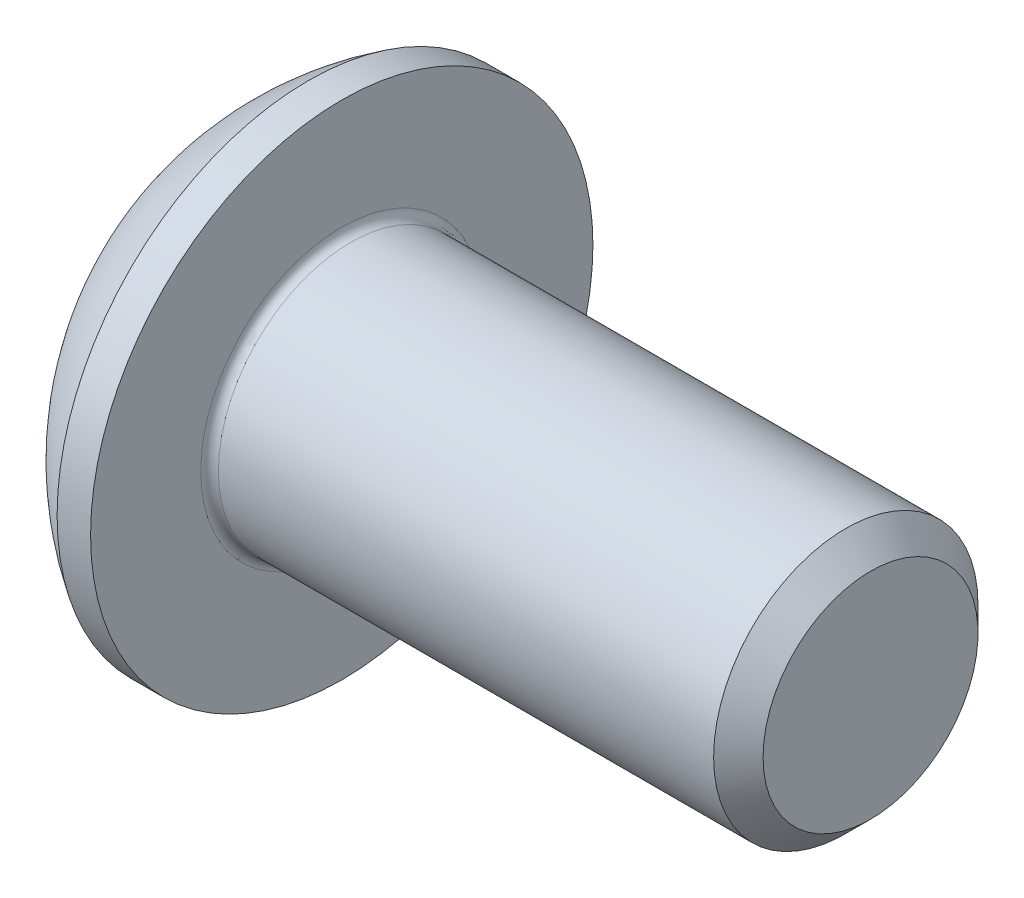
ISO-10303-21;
HEADER;
FILE_DESCRIPTION(('STEP AP214'),'2;1');
FILE_NAME('part.step','',(''),(''),'','','');
FILE_SCHEMA(('AUTOMOTIVE_DESIGN { 1 0 10303 214 1 1 1 1 }'));
ENDSEC;
DATA;
#1=APPLICATION_CONTEXT('core data for automotive mechanical design processes');
#2=APPLICATION_PROTOCOL_DEFINITION('international standard','automotive_design',2000,#1);
#3=PRODUCT_CONTEXT('',#1,'mechanical');
#4=PRODUCT('Part','Part','',(#3));
#5=PRODUCT_RELATED_PRODUCT_CATEGORY('part','',(#4));
#6=PRODUCT_DEFINITION_FORMATION('','',#4);
#7=PRODUCT_DEFINITION_CONTEXT('part definition',#1,'design');
#8=PRODUCT_DEFINITION('design','',#6,#7);
#9=PRODUCT_DEFINITION_SHAPE('','',#8);
#10=(LENGTH_UNIT() NAMED_UNIT(*) SI_UNIT(.MILLI.,.METRE.));
#11=(NAMED_UNIT(*) PLANE_ANGLE_UNIT() SI_UNIT($,.RADIAN.));
#12=(NAMED_UNIT(*) SI_UNIT($,.STERADIAN.) SOLID_ANGLE_UNIT());
#13=UNCERTAINTY_MEASURE_WITH_UNIT(LENGTH_MEASURE(1.E-05),#10,'distance_accuracy_value','');
#14=(GEOMETRIC_REPRESENTATION_CONTEXT(3) GLOBAL_UNCERTAINTY_ASSIGNED_CONTEXT((#13)) GLOBAL_UNIT_ASSIGNED_CONTEXT((#10,
#11,#12)) REPRESENTATION_CONTEXT('',''));
#15=CARTESIAN_POINT('',(0.,0.,0.));
#16=DIRECTION('',(0.,0.,1.));
#17=DIRECTION('',(1.,0.,0.));
#18=AXIS2_PLACEMENT_3D('',#15,#16,#17);
#19=CARTESIAN_POINT('',(0.,0.,0.));
#20=DIRECTION('',(-1.,0.,0.));
#21=DIRECTION('',(0.,0.,1.));
#22=AXIS2_PLACEMENT_3D('',#19,#20,#21);
#23=PLANE('',#22);
#24=CARTESIAN_POINT('',(0.,0.,0.));
#25=DIRECTION('',(-1.,0.,0.));
#26=DIRECTION('',(0.,0.,1.));
#27=AXIS2_PLACEMENT_3D('',#24,#25,#26);
#28=CIRCLE('',#27,1.425);
#29=CARTESIAN_POINT('',(0.,0.,1.425));
#30=VERTEX_POINT('',#29);
#31=EDGE_CURVE('E152',#30,#30,#28,.T.);
#32=ORIENTED_EDGE('',*,*,#31,.T.);
#33=EDGE_LOOP('',(#32));
#34=FACE_BOUND('',#33,.T.);
#35=DIRECTION('',(0.,-1.,0.));
#36=VECTOR('',#35,1.);
#37=CARTESIAN_POINT('',(0.,-0.577350269189625,0.999999999999998));
#38=LINE('',#37,#36);
#39=CARTESIAN_POINT('',(0.,0.577350269189628,1.));
#40=VERTEX_POINT('',#39);
#41=CARTESIAN_POINT('',(0.,-0.577350269189625,0.999999999999998));
#42=VERTEX_POINT('',#41);
#43=EDGE_CURVE('E47',#40,#42,#38,.T.);
#44=ORIENTED_EDGE('',*,*,#43,.T.);
#45=DIRECTION('',(0.,-0.499999999999999,-0.866025403784439));
#46=VECTOR('',#45,1.);
#47=CARTESIAN_POINT('',(0.,-1.15470053837925,0.));
#48=LINE('',#47,#46);
#49=CARTESIAN_POINT('',(0.,-1.15470053837925,0.));
#50=VERTEX_POINT('',#49);
#51=EDGE_CURVE('E272',#42,#50,#48,.T.);
#52=ORIENTED_EDGE('',*,*,#51,.T.);
#53=DIRECTION('',(0.,0.499999999999997,-0.86602540378444));
#54=VECTOR('',#53,1.);
#55=CARTESIAN_POINT('',(0.,-0.577350269189626,-1.));
#56=LINE('',#55,#54);
#57=CARTESIAN_POINT('',(0.,-0.577350269189626,-1.));
#58=VERTEX_POINT('',#57);
#59=EDGE_CURVE('E127',#50,#58,#56,.T.);
#60=ORIENTED_EDGE('',*,*,#59,.T.);
#61=DIRECTION('',(0.,1.,0.));
#62=VECTOR('',#61,1.);
#63=CARTESIAN_POINT('',(0.,0.577350269189628,-1.));
#64=LINE('',#63,#62);
#65=CARTESIAN_POINT('',(0.,0.577350269189628,-1.));
#66=VERTEX_POINT('',#65);
#67=EDGE_CURVE('E275',#58,#66,#64,.T.);
#68=ORIENTED_EDGE('',*,*,#67,.T.);
#69=DIRECTION('',(0.,0.499999999999998,0.866025403784439));
#70=VECTOR('',#69,1.);
#71=CARTESIAN_POINT('',(0.,1.15470053837925,0.));
#72=LINE('',#71,#70);
#73=CARTESIAN_POINT('',(0.,1.15470053837925,0.));
#74=VERTEX_POINT('',#73);
#75=EDGE_CURVE('E277',#66,#74,#72,.T.);
#76=ORIENTED_EDGE('',*,*,#75,.T.);
#77=DIRECTION('',(0.,-0.499999999999998,0.866025403784439));
#78=VECTOR('',#77,1.);
#79=CARTESIAN_POINT('',(0.,0.577350269189628,1.));
#80=LINE('',#79,#78);
#81=EDGE_CURVE('E279',#74,#40,#80,.T.);
#82=ORIENTED_EDGE('',*,*,#81,.T.);
#83=EDGE_LOOP('',(#44,#52,#60,#68,#76,#82));
#84=FACE_BOUND('',#83,.T.);
#85=ADVANCED_FACE('F32',(#34,#84),#23,.T.);
#86=CARTESIAN_POINT('',(3.03337598425198,0.,0.));
#87=DIRECTION('',(-1.,0.,0.));
#88=DIRECTION('',(0.,1.,0.));
#89=AXIS2_PLACEMENT_3D('',#86,#87,#88);
#90=SPHERICAL_SURFACE('',#89,3.35141684393879);
#91=CARTESIAN_POINT('',(1.27,0.,0.));
#92=DIRECTION('',(-1.,0.,0.));
#93=DIRECTION('',(0.,0.,1.));
#94=AXIS2_PLACEMENT_3D('',#91,#92,#93);
#95=CIRCLE('',#94,2.85);
#96=CARTESIAN_POINT('',(1.27,0.,2.85));
#97=VERTEX_POINT('',#96);
#98=EDGE_CURVE('E149',#97,#97,#95,.T.);
#99=ORIENTED_EDGE('',*,*,#98,.T.);
#100=EDGE_LOOP('',(#99));
#101=FACE_BOUND('',#100,.T.);
#102=ORIENTED_EDGE('',*,*,#31,.F.);
#103=EDGE_LOOP('',(#102));
#104=FACE_BOUND('',#103,.T.);
#105=ADVANCED_FACE('F173',(#101,#104),#90,.T.);
#106=CARTESIAN_POINT('',(0.,0.,0.));
#107=DIRECTION('',(-1.,0.,0.));
#108=DIRECTION('',(0.,0.,1.));
#109=AXIS2_PLACEMENT_3D('',#106,#107,#108);
#110=CYLINDRICAL_SURFACE('',#109,2.85);
#111=ORIENTED_EDGE('',*,*,#98,.F.);
#112=EDGE_LOOP('',(#111));
#113=FACE_BOUND('',#112,.T.);
#114=CARTESIAN_POINT('',(1.65,0.,0.));
#115=DIRECTION('',(-1.,0.,0.));
#116=DIRECTION('',(0.,0.,1.));
#117=AXIS2_PLACEMENT_3D('',#114,#115,#116);
#118=CIRCLE('',#117,2.85);
#119=CARTESIAN_POINT('',(1.65,0.,2.85));
#120=VERTEX_POINT('',#119);
#121=EDGE_CURVE('E146',#120,#120,#118,.T.);
#122=ORIENTED_EDGE('',*,*,#121,.T.);
#123=EDGE_LOOP('',(#122));
#124=FACE_BOUND('',#123,.T.);
#125=ADVANCED_FACE('F178',(#113,#124),#110,.T.);
#126=CARTESIAN_POINT('',(1.65,1.49999999999999,0.));
#127=DIRECTION('',(-1.,0.,0.));
#128=DIRECTION('',(0.,0.,1.));
#129=AXIS2_PLACEMENT_3D('',#126,#127,#128);
#130=PLANE('',#129);
#131=CARTESIAN_POINT('',(1.65,0.,0.));
#132=DIRECTION('',(-1.,0.,0.));
#133=DIRECTION('',(0.,0.,1.));
#134=AXIS2_PLACEMENT_3D('',#131,#132,#133);
#135=CIRCLE('',#134,1.6);
#136=CARTESIAN_POINT('',(1.65,0.,1.6));
#137=VERTEX_POINT('',#136);
#138=EDGE_CURVE('E40',#137,#137,#135,.T.);
#139=ORIENTED_EDGE('',*,*,#138,.T.);
#140=EDGE_LOOP('',(#139));
#141=FACE_BOUND('',#140,.T.);
#142=ORIENTED_EDGE('',*,*,#121,.F.);
#143=EDGE_LOOP('',(#142));
#144=FACE_BOUND('',#143,.T.);
#145=ADVANCED_FACE('F157',(#141,#144),#130,.F.);
#146=CARTESIAN_POINT('',(0.,0.,0.));
#147=DIRECTION('',(-1.,0.,0.));
#148=DIRECTION('',(0.,0.,1.));
#149=AXIS2_PLACEMENT_3D('',#146,#147,#148);
#150=CYLINDRICAL_SURFACE('',#149,1.5);
#151=CARTESIAN_POINT('',(1.75,0.,0.));
#152=DIRECTION('',(-1.,0.,0.));
#153=DIRECTION('',(0.,0.,1.));
#154=AXIS2_PLACEMENT_3D('',#151,#152,#153);
#155=CIRCLE('',#154,1.5);
#156=CARTESIAN_POINT('',(1.75,0.,1.5));
#157=VERTEX_POINT('',#156);
#158=EDGE_CURVE('E11',#157,#157,#155,.F.);
#159=ORIENTED_EDGE('',*,*,#158,.T.);
#160=EDGE_LOOP('',(#159));
#161=FACE_BOUND('',#160,.T.);
#162=CARTESIAN_POINT('',(7.3695,0.,0.));
#163=DIRECTION('',(-1.,0.,0.));
#164=DIRECTION('',(0.,0.,1.));
#165=AXIS2_PLACEMENT_3D('',#162,#163,#164);
#166=CIRCLE('',#165,1.5);
#167=CARTESIAN_POINT('',(7.3695,0.,1.5));
#168=VERTEX_POINT('',#167);
#169=EDGE_CURVE('E143',#168,#168,#166,.T.);
#170=ORIENTED_EDGE('',*,*,#169,.T.);
#171=EDGE_LOOP('',(#170));
#172=FACE_BOUND('',#171,.T.);
#173=ADVANCED_FACE('F187',(#161,#172),#150,.T.);
#174=CARTESIAN_POINT('',(7.65,0.,0.));
#175=DIRECTION('',(-1.,0.,0.));
#176=DIRECTION('',(0.,0.,1.));
#177=AXIS2_PLACEMENT_3D('',#174,#175,#176);
#178=CONICAL_SURFACE('',#177,1.2195,0.785398163397446);
#179=ORIENTED_EDGE('',*,*,#169,.F.);
#180=EDGE_LOOP('',(#179));
#181=FACE_BOUND('',#180,.T.);
#182=CARTESIAN_POINT('',(7.65,0.,0.));
#183=DIRECTION('',(-1.,0.,0.));
#184=DIRECTION('',(0.,0.,1.));
#185=AXIS2_PLACEMENT_3D('',#182,#183,#184);
#186=CIRCLE('',#185,1.2195);
#187=CARTESIAN_POINT('',(7.65,0.,1.2195));
#188=VERTEX_POINT('',#187);
#189=EDGE_CURVE('E139',#188,#188,#186,.T.);
#190=ORIENTED_EDGE('',*,*,#189,.T.);
#191=EDGE_LOOP('',(#190));
#192=FACE_BOUND('',#191,.T.);
#193=ADVANCED_FACE('F168',(#181,#192),#178,.T.);
#194=CARTESIAN_POINT('',(7.65,0.,0.));
#195=DIRECTION('',(-1.,0.,0.));
#196=DIRECTION('',(0.,0.,1.));
#197=AXIS2_PLACEMENT_3D('',#194,#195,#196);
#198=PLANE('',#197);
#199=ORIENTED_EDGE('',*,*,#189,.F.);
#200=EDGE_LOOP('',(#199));
#201=FACE_BOUND('',#200,.T.);
#202=ADVANCED_FACE('F161',(#201),#198,.F.);
#203=CARTESIAN_POINT('',(1.75,0.,0.));
#204=DIRECTION('',(-1.,0.,0.));
#205=DIRECTION('',(0.,0.,1.));
#206=AXIS2_PLACEMENT_3D('',#203,#204,#205);
#207=TOROIDAL_SURFACE('',#206,1.6,0.1);
#208=ORIENTED_EDGE('',*,*,#158,.F.);
#209=EDGE_LOOP('',(#208));
#210=FACE_BOUND('',#209,.T.);
#211=ORIENTED_EDGE('',*,*,#138,.F.);
#212=EDGE_LOOP('',(#211));
#213=FACE_BOUND('',#212,.T.);
#214=ADVANCED_FACE('F34',(#210,#213),#207,.F.);
#215=CARTESIAN_POINT('',(1.04,-1.15470053837925,0.));
#216=DIRECTION('',(0.,0.866025403784439,-0.499999999999999));
#217=DIRECTION('',(0.,0.499999999999999,0.866025403784439));
#218=AXIS2_PLACEMENT_3D('',#215,#216,#217);
#219=PLANE('',#218);
#220=DIRECTION('',(0.,-0.499999999999999,-0.866025403784439));
#221=VECTOR('',#220,1.);
#222=CARTESIAN_POINT('',(1.04,-1.15470053837925,0.));
#223=LINE('',#222,#221);
#224=CARTESIAN_POINT('',(1.04,-0.577350269189625,0.999999999999998));
#225=VERTEX_POINT('',#224);
#226=CARTESIAN_POINT('',(1.04,-0.866025403784437,0.499999999999998));
#227=VERTEX_POINT('',#226);
#228=EDGE_CURVE('E113',#225,#227,#223,.T.);
#229=ORIENTED_EDGE('',*,*,#228,.T.);
#230=CARTESIAN_POINT('',(1.04,-1.15470053837925,0.));
#231=VERTEX_POINT('',#230);
#232=EDGE_CURVE('E108',#227,#231,#223,.T.);
#233=ORIENTED_EDGE('',*,*,#232,.T.);
#234=DIRECTION('',(-1.,0.,0.));
#235=VECTOR('',#234,1.);
#236=CARTESIAN_POINT('',(1.04,-1.15470053837925,0.));
#237=LINE('',#236,#235);
#238=EDGE_CURVE('E110',#231,#50,#237,.T.);
#239=ORIENTED_EDGE('',*,*,#238,.T.);
#240=ORIENTED_EDGE('',*,*,#51,.F.);
#241=DIRECTION('',(-1.,0.,0.));
#242=VECTOR('',#241,1.);
#243=CARTESIAN_POINT('',(1.04,-0.577350269189625,0.999999999999998));
#244=LINE('',#243,#242);
#245=EDGE_CURVE('E268',#225,#42,#244,.T.);
#246=ORIENTED_EDGE('',*,*,#245,.F.);
#247=EDGE_LOOP('',(#229,#233,#239,#240,#246));
#248=FACE_BOUND('',#247,.T.);
#249=ADVANCED_FACE('F109',(#248),#219,.T.);
#250=CARTESIAN_POINT('',(1.04,-0.577350269189626,-1.));
#251=DIRECTION('',(0.,0.86602540378444,0.499999999999998));
#252=DIRECTION('',(0.,-0.499999999999998,0.86602540378444));
#253=AXIS2_PLACEMENT_3D('',#250,#251,#252);
#254=PLANE('',#253);
#255=DIRECTION('',(0.,0.499999999999997,-0.86602540378444));
#256=VECTOR('',#255,1.);
#257=CARTESIAN_POINT('',(1.04,-0.577350269189626,-1.));
#258=LINE('',#257,#256);
#259=CARTESIAN_POINT('',(1.04,-0.86602540378444,-0.499999999999997));
#260=VERTEX_POINT('',#259);
#261=EDGE_CURVE('E55',#231,#260,#258,.T.);
#262=ORIENTED_EDGE('',*,*,#261,.T.);
#263=CARTESIAN_POINT('',(1.04,-0.577350269189626,-1.));
#264=VERTEX_POINT('',#263);
#265=EDGE_CURVE('E122',#260,#264,#258,.T.);
#266=ORIENTED_EDGE('',*,*,#265,.T.);
#267=DIRECTION('',(-1.,0.,0.));
#268=VECTOR('',#267,1.);
#269=CARTESIAN_POINT('',(1.04,-0.577350269189626,-1.));
#270=LINE('',#269,#268);
#271=EDGE_CURVE('E129',#264,#58,#270,.T.);
#272=ORIENTED_EDGE('',*,*,#271,.T.);
#273=ORIENTED_EDGE('',*,*,#59,.F.);
#274=ORIENTED_EDGE('',*,*,#238,.F.);
#275=EDGE_LOOP('',(#262,#266,#272,#273,#274));
#276=FACE_BOUND('',#275,.T.);
#277=ADVANCED_FACE('F125',(#276),#254,.T.);
#278=CARTESIAN_POINT('',(1.04,0.577350269189628,-1.));
#279=DIRECTION('',(0.,0.,1.));
#280=DIRECTION('',(0.,-1.,0.));
#281=AXIS2_PLACEMENT_3D('',#278,#279,#280);
#282=PLANE('',#281);
#283=DIRECTION('',(0.,1.,0.));
#284=VECTOR('',#283,1.);
#285=CARTESIAN_POINT('',(1.04,0.577350269189628,-1.));
#286=LINE('',#285,#284);
#287=CARTESIAN_POINT('',(1.04,0.,-1.));
#288=VERTEX_POINT('',#287);
#289=EDGE_CURVE('E249',#264,#288,#286,.T.);
#290=ORIENTED_EDGE('',*,*,#289,.T.);
#291=CARTESIAN_POINT('',(1.04,0.577350269189628,-1.));
#292=VERTEX_POINT('',#291);
#293=EDGE_CURVE('E121',#288,#292,#286,.T.);
#294=ORIENTED_EDGE('',*,*,#293,.T.);
#295=DIRECTION('',(-1.,0.,0.));
#296=VECTOR('',#295,1.);
#297=CARTESIAN_POINT('',(1.04,0.577350269189628,-1.));
#298=LINE('',#297,#296);
#299=EDGE_CURVE('E134',#292,#66,#298,.T.);
#300=ORIENTED_EDGE('',*,*,#299,.T.);
#301=ORIENTED_EDGE('',*,*,#67,.F.);
#302=ORIENTED_EDGE('',*,*,#271,.F.);
#303=EDGE_LOOP('',(#290,#294,#300,#301,#302));
#304=FACE_BOUND('',#303,.T.);
#305=ADVANCED_FACE('F201',(#304),#282,.T.);
#306=CARTESIAN_POINT('',(1.04,1.15470053837925,0.));
#307=DIRECTION('',(0.,-0.86602540378444,0.499999999999998));
#308=DIRECTION('',(0.,-0.499999999999998,-0.86602540378444));
#309=AXIS2_PLACEMENT_3D('',#306,#307,#308);
#310=PLANE('',#309);
#311=DIRECTION('',(0.,0.499999999999998,0.866025403784439));
#312=VECTOR('',#311,1.);
#313=CARTESIAN_POINT('',(1.04,1.15470053837925,0.));
#314=LINE('',#313,#312);
#315=CARTESIAN_POINT('',(1.04,0.86602540378444,-0.499999999999999));
#316=VERTEX_POINT('',#315);
#317=EDGE_CURVE('E238',#292,#316,#314,.T.);
#318=ORIENTED_EDGE('',*,*,#317,.T.);
#319=CARTESIAN_POINT('',(1.04,1.15470053837925,0.));
#320=VERTEX_POINT('',#319);
#321=EDGE_CURVE('E243',#316,#320,#314,.T.);
#322=ORIENTED_EDGE('',*,*,#321,.T.);
#323=DIRECTION('',(-1.,0.,0.));
#324=VECTOR('',#323,1.);
#325=CARTESIAN_POINT('',(1.04,1.15470053837925,0.));
#326=LINE('',#325,#324);
#327=EDGE_CURVE('E283',#320,#74,#326,.T.);
#328=ORIENTED_EDGE('',*,*,#327,.T.);
#329=ORIENTED_EDGE('',*,*,#75,.F.);
#330=ORIENTED_EDGE('',*,*,#299,.F.);
#331=EDGE_LOOP('',(#318,#322,#328,#329,#330));
#332=FACE_BOUND('',#331,.T.);
#333=ADVANCED_FACE('F204',(#332),#310,.T.);
#334=CARTESIAN_POINT('',(1.04,0.577350269189628,1.));
#335=DIRECTION('',(0.,-0.86602540378444,-0.499999999999998));
#336=DIRECTION('',(0.,0.499999999999998,-0.86602540378444));
#337=AXIS2_PLACEMENT_3D('',#334,#335,#336);
#338=PLANE('',#337);
#339=DIRECTION('',(0.,-0.499999999999998,0.866025403784439));
#340=VECTOR('',#339,1.);
#341=CARTESIAN_POINT('',(1.04,0.577350269189628,1.));
#342=LINE('',#341,#340);
#343=CARTESIAN_POINT('',(1.04,0.86602540378444,0.499999999999999));
#344=VERTEX_POINT('',#343);
#345=EDGE_CURVE('E246',#320,#344,#342,.T.);
#346=ORIENTED_EDGE('',*,*,#345,.T.);
#347=CARTESIAN_POINT('',(1.04,0.577350269189628,1.));
#348=VERTEX_POINT('',#347);
#349=EDGE_CURVE('E254',#344,#348,#342,.T.);
#350=ORIENTED_EDGE('',*,*,#349,.T.);
#351=DIRECTION('',(-1.,0.,0.));
#352=VECTOR('',#351,1.);
#353=CARTESIAN_POINT('',(1.04,0.577350269189628,1.));
#354=LINE('',#353,#352);
#355=EDGE_CURVE('E267',#348,#40,#354,.T.);
#356=ORIENTED_EDGE('',*,*,#355,.T.);
#357=ORIENTED_EDGE('',*,*,#81,.F.);
#358=ORIENTED_EDGE('',*,*,#327,.F.);
#359=EDGE_LOOP('',(#346,#350,#356,#357,#358));
#360=FACE_BOUND('',#359,.T.);
#361=ADVANCED_FACE('F208',(#360),#338,.T.);
#362=CARTESIAN_POINT('',(1.04,-0.577350269189625,0.999999999999998));
#363=DIRECTION('',(0.,0.,-1.));
#364=DIRECTION('',(0.,1.,0.));
#365=AXIS2_PLACEMENT_3D('',#362,#363,#364);
#366=PLANE('',#365);
#367=DIRECTION('',(0.,-1.,0.));
#368=VECTOR('',#367,1.);
#369=CARTESIAN_POINT('',(1.04,-0.577350269189625,0.999999999999998));
#370=LINE('',#369,#368);
#371=CARTESIAN_POINT('',(1.04,0.,1.));
#372=VERTEX_POINT('',#371);
#373=EDGE_CURVE('E260',#348,#372,#370,.T.);
#374=ORIENTED_EDGE('',*,*,#373,.T.);
#375=EDGE_CURVE('E262',#372,#225,#370,.T.);
#376=ORIENTED_EDGE('',*,*,#375,.T.);
#377=ORIENTED_EDGE('',*,*,#245,.T.);
#378=ORIENTED_EDGE('',*,*,#43,.F.);
#379=ORIENTED_EDGE('',*,*,#355,.F.);
#380=EDGE_LOOP('',(#374,#376,#377,#378,#379));
#381=FACE_BOUND('',#380,.T.);
#382=ADVANCED_FACE('F212',(#381),#366,.T.);
#383=CARTESIAN_POINT('',(1.04,-1.73205080756887,-0.999999999999999));
#384=DIRECTION('',(1.,0.,0.));
#385=DIRECTION('',(0.,0.,-1.));
#386=AXIS2_PLACEMENT_3D('',#383,#384,#385);
#387=PLANE('',#386);
#388=CARTESIAN_POINT('',(1.04,0.,0.));
#389=DIRECTION('',(-1.,0.,0.));
#390=DIRECTION('',(0.,0.,1.));
#391=AXIS2_PLACEMENT_3D('',#388,#389,#390);
#392=CIRCLE('',#391,1.);
#393=EDGE_CURVE('E235',#316,#288,#392,.T.);
#394=ORIENTED_EDGE('',*,*,#393,.F.);
#395=ORIENTED_EDGE('',*,*,#317,.F.);
#396=ORIENTED_EDGE('',*,*,#293,.F.);
#397=EDGE_LOOP('',(#394,#395,#396));
#398=FACE_BOUND('',#397,.T.);
#399=ADVANCED_FACE('F216',(#398),#387,.F.);
#400=EDGE_CURVE('E140',#344,#316,#392,.T.);
#401=ORIENTED_EDGE('',*,*,#400,.F.);
#402=ORIENTED_EDGE('',*,*,#345,.F.);
#403=ORIENTED_EDGE('',*,*,#321,.F.);
#404=EDGE_LOOP('',(#401,#402,#403));
#405=FACE_BOUND('',#404,.T.);
#406=ADVANCED_FACE('F225',(#405),#387,.F.);
#407=EDGE_CURVE('E133',#372,#344,#392,.T.);
#408=ORIENTED_EDGE('',*,*,#407,.F.);
#409=ORIENTED_EDGE('',*,*,#373,.F.);
#410=ORIENTED_EDGE('',*,*,#349,.F.);
#411=EDGE_LOOP('',(#408,#409,#410));
#412=FACE_BOUND('',#411,.T.);
#413=ADVANCED_FACE('F230',(#412),#387,.F.);
#414=EDGE_CURVE('E128',#227,#372,#392,.T.);
#415=ORIENTED_EDGE('',*,*,#414,.F.);
#416=ORIENTED_EDGE('',*,*,#228,.F.);
#417=ORIENTED_EDGE('',*,*,#375,.F.);
#418=EDGE_LOOP('',(#415,#416,#417));
#419=FACE_BOUND('',#418,.T.);
#420=ADVANCED_FACE('F223',(#419),#387,.F.);
#421=EDGE_CURVE('E119',#260,#227,#392,.T.);
#422=ORIENTED_EDGE('',*,*,#421,.F.);
#423=ORIENTED_EDGE('',*,*,#261,.F.);
#424=ORIENTED_EDGE('',*,*,#232,.F.);
#425=EDGE_LOOP('',(#422,#423,#424));
#426=FACE_BOUND('',#425,.T.);
#427=ADVANCED_FACE('F118',(#426),#387,.F.);
#428=EDGE_CURVE('E241',#288,#260,#392,.T.);
#429=ORIENTED_EDGE('',*,*,#428,.F.);
#430=ORIENTED_EDGE('',*,*,#289,.F.);
#431=ORIENTED_EDGE('',*,*,#265,.F.);
#432=EDGE_LOOP('',(#429,#430,#431));
#433=FACE_BOUND('',#432,.T.);
#434=ADVANCED_FACE('F196',(#433),#387,.F.);
#435=CARTESIAN_POINT('',(1.61735026918963,0.,0.));
#436=DIRECTION('',(-1.,0.,0.));
#437=DIRECTION('',(0.,0.,1.));
#438=AXIS2_PLACEMENT_3D('',#435,#436,#437);
#439=CONICAL_SURFACE('',#438,0.,1.04719755119659);
#440=ORIENTED_EDGE('',*,*,#407,.T.);
#441=ORIENTED_EDGE('',*,*,#400,.T.);
#442=ORIENTED_EDGE('',*,*,#393,.T.);
#443=ORIENTED_EDGE('',*,*,#428,.T.);
#444=ORIENTED_EDGE('',*,*,#421,.T.);
#445=ORIENTED_EDGE('',*,*,#414,.T.);
#446=EDGE_LOOP('',(#440,#441,#442,#443,#444,#445));
#447=FACE_BOUND('',#446,.T.);
#448=CARTESIAN_POINT('',(1.61735026918963,0.,0.));
#449=VERTEX_POINT('',#448);
#450=VERTEX_LOOP('',#449);
#451=FACE_BOUND('',#450,.T.);
#452=ADVANCED_FACE('F194',(#447,#451),#439,.F.);
#453=CLOSED_SHELL('',(#85,#105,#125,#145,#173,#193,#202,#214,#249,#277,#305,#333,#361,#382,#399,
#406,#413,#420,#427,#434,#452));
#454=MANIFOLD_SOLID_BREP('B2',#453);
#455=ADVANCED_BREP_SHAPE_REPRESENTATION('',(#18,#454),#14);
#456=SHAPE_DEFINITION_REPRESENTATION(#9,#455);
ENDSEC;
END-ISO-10303-21;
